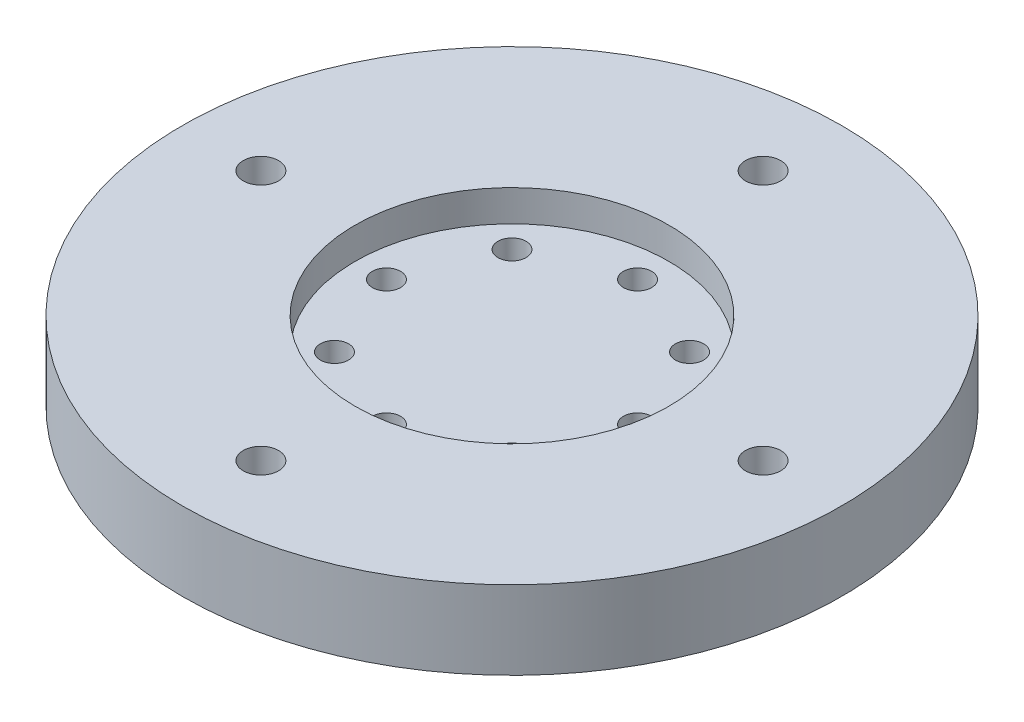
ISO-10303-21;
HEADER;
FILE_DESCRIPTION(('STEP AP214'),'2;1');
FILE_NAME('part.step','',(''),(''),'','','');
FILE_SCHEMA(('AUTOMOTIVE_DESIGN { 1 0 10303 214 1 1 1 1 }'));
ENDSEC;
DATA;
#1=APPLICATION_CONTEXT('core data for automotive mechanical design processes');
#2=APPLICATION_PROTOCOL_DEFINITION('international standard','automotive_design',2000,#1);
#3=PRODUCT_CONTEXT('',#1,'mechanical');
#4=PRODUCT('Part','Part','',(#3));
#5=PRODUCT_RELATED_PRODUCT_CATEGORY('part','',(#4));
#6=PRODUCT_DEFINITION_FORMATION('','',#4);
#7=PRODUCT_DEFINITION_CONTEXT('part definition',#1,'design');
#8=PRODUCT_DEFINITION('design','',#6,#7);
#9=PRODUCT_DEFINITION_SHAPE('','',#8);
#10=(LENGTH_UNIT() NAMED_UNIT(*) SI_UNIT(.MILLI.,.METRE.));
#11=(NAMED_UNIT(*) PLANE_ANGLE_UNIT() SI_UNIT($,.RADIAN.));
#12=(NAMED_UNIT(*) SI_UNIT($,.STERADIAN.) SOLID_ANGLE_UNIT());
#13=UNCERTAINTY_MEASURE_WITH_UNIT(LENGTH_MEASURE(1.E-05),#10,'distance_accuracy_value','');
#14=(GEOMETRIC_REPRESENTATION_CONTEXT(3) GLOBAL_UNCERTAINTY_ASSIGNED_CONTEXT((#13)) GLOBAL_UNIT_ASSIGNED_CONTEXT((#10,
#11,#12)) REPRESENTATION_CONTEXT('',''));
#15=CARTESIAN_POINT('',(0.,0.,0.));
#16=DIRECTION('',(0.,0.,1.));
#17=DIRECTION('',(1.,0.,0.));
#18=AXIS2_PLACEMENT_3D('',#15,#16,#17);
#19=CARTESIAN_POINT('',(0.,5.,0.));
#20=DIRECTION('',(0.,-1.,0.));
#21=DIRECTION('',(0.,0.,-1.));
#22=AXIS2_PLACEMENT_3D('',#19,#20,#21);
#23=CYLINDRICAL_SURFACE('',#22,21.);
#24=CARTESIAN_POINT('',(0.,5.,0.));
#25=DIRECTION('',(0.,1.,0.));
#26=DIRECTION('',(0.,0.,1.));
#27=AXIS2_PLACEMENT_3D('',#24,#25,#26);
#28=CIRCLE('',#27,21.);
#29=CARTESIAN_POINT('',(0.,5.,21.));
#30=VERTEX_POINT('',#29);
#31=EDGE_CURVE('E10',#30,#30,#28,.T.);
#32=ORIENTED_EDGE('',*,*,#31,.F.);
#33=EDGE_LOOP('',(#32));
#34=FACE_BOUND('',#33,.T.);
#35=CARTESIAN_POINT('',(0.,0.,0.));
#36=DIRECTION('',(0.,1.,0.));
#37=DIRECTION('',(0.,0.,1.));
#38=AXIS2_PLACEMENT_3D('',#35,#36,#37);
#39=CIRCLE('',#38,21.);
#40=CARTESIAN_POINT('',(0.,0.,21.));
#41=VERTEX_POINT('',#40);
#42=EDGE_CURVE('E34',#41,#41,#39,.T.);
#43=ORIENTED_EDGE('',*,*,#42,.T.);
#44=EDGE_LOOP('',(#43));
#45=FACE_BOUND('',#44,.T.);
#46=ADVANCED_FACE('F31',(#34,#45),#23,.T.);
#47=CARTESIAN_POINT('',(0.,5.,0.));
#48=DIRECTION('',(0.,1.,0.));
#49=DIRECTION('',(0.,0.,1.));
#50=AXIS2_PLACEMENT_3D('',#47,#48,#49);
#51=PLANE('',#50);
#52=CARTESIAN_POINT('',(-16.,5.,0.));
#53=DIRECTION('',(0.,1.,0.));
#54=DIRECTION('',(0.,0.,1.));
#55=AXIS2_PLACEMENT_3D('',#52,#53,#54);
#56=CIRCLE('',#55,1.125);
#57=CARTESIAN_POINT('',(-16.,5.,1.125));
#58=VERTEX_POINT('',#57);
#59=EDGE_CURVE('E102',#58,#58,#56,.F.);
#60=ORIENTED_EDGE('',*,*,#59,.T.);
#61=EDGE_LOOP('',(#60));
#62=FACE_BOUND('',#61,.T.);
#63=CARTESIAN_POINT('',(0.,5.,16.));
#64=DIRECTION('',(0.,1.,0.));
#65=DIRECTION('',(0.,0.,1.));
#66=AXIS2_PLACEMENT_3D('',#63,#64,#65);
#67=CIRCLE('',#66,1.125);
#68=CARTESIAN_POINT('',(0.,5.,17.125));
#69=VERTEX_POINT('',#68);
#70=EDGE_CURVE('E110',#69,#69,#67,.F.);
#71=ORIENTED_EDGE('',*,*,#70,.T.);
#72=EDGE_LOOP('',(#71));
#73=FACE_BOUND('',#72,.T.);
#74=CARTESIAN_POINT('',(16.,5.,0.));
#75=DIRECTION('',(0.,1.,0.));
#76=DIRECTION('',(0.,0.,1.));
#77=AXIS2_PLACEMENT_3D('',#74,#75,#76);
#78=CIRCLE('',#77,1.125);
#79=CARTESIAN_POINT('',(16.,5.,1.125));
#80=VERTEX_POINT('',#79);
#81=EDGE_CURVE('E103',#80,#80,#78,.F.);
#82=ORIENTED_EDGE('',*,*,#81,.T.);
#83=EDGE_LOOP('',(#82));
#84=FACE_BOUND('',#83,.T.);
#85=CARTESIAN_POINT('',(0.,5.,-16.));
#86=DIRECTION('',(0.,1.,0.));
#87=DIRECTION('',(0.,0.,1.));
#88=AXIS2_PLACEMENT_3D('',#85,#86,#87);
#89=CIRCLE('',#88,1.125);
#90=CARTESIAN_POINT('',(0.,5.,-14.875));
#91=VERTEX_POINT('',#90);
#92=EDGE_CURVE('E80',#91,#91,#89,.F.);
#93=ORIENTED_EDGE('',*,*,#92,.T.);
#94=EDGE_LOOP('',(#93));
#95=FACE_BOUND('',#94,.T.);
#96=CARTESIAN_POINT('',(0.,5.,0.));
#97=DIRECTION('',(0.,1.,0.));
#98=DIRECTION('',(0.,0.,1.));
#99=AXIS2_PLACEMENT_3D('',#96,#97,#98);
#100=CIRCLE('',#99,10.);
#101=CARTESIAN_POINT('',(0.,5.,10.));
#102=VERTEX_POINT('',#101);
#103=EDGE_CURVE('E43',#102,#102,#100,.T.);
#104=ORIENTED_EDGE('',*,*,#103,.F.);
#105=EDGE_LOOP('',(#104));
#106=FACE_BOUND('',#105,.T.);
#107=ORIENTED_EDGE('',*,*,#31,.T.);
#108=EDGE_LOOP('',(#107));
#109=FACE_BOUND('',#108,.T.);
#110=ADVANCED_FACE('F128',(#62,#73,#84,#95,#106,#109),#51,.T.);
#111=CARTESIAN_POINT('',(0.,0.,0.));
#112=DIRECTION('',(0.,1.,0.));
#113=DIRECTION('',(0.,0.,1.));
#114=AXIS2_PLACEMENT_3D('',#111,#112,#113);
#115=PLANE('',#114);
#116=CARTESIAN_POINT('',(-16.,0.,0.));
#117=DIRECTION('',(0.,-1.,0.));
#118=DIRECTION('',(0.,0.,-1.));
#119=AXIS2_PLACEMENT_3D('',#116,#117,#118);
#120=CIRCLE('',#119,1.125);
#121=CARTESIAN_POINT('',(-16.,0.,-1.125));
#122=VERTEX_POINT('',#121);
#123=EDGE_CURVE('E113',#122,#122,#120,.T.);
#124=ORIENTED_EDGE('',*,*,#123,.F.);
#125=EDGE_LOOP('',(#124));
#126=FACE_BOUND('',#125,.T.);
#127=CARTESIAN_POINT('',(0.,0.,16.));
#128=DIRECTION('',(0.,-1.,0.));
#129=DIRECTION('',(0.,0.,-1.));
#130=AXIS2_PLACEMENT_3D('',#127,#128,#129);
#131=CIRCLE('',#130,1.125);
#132=CARTESIAN_POINT('',(0.,0.,14.875));
#133=VERTEX_POINT('',#132);
#134=EDGE_CURVE('E106',#133,#133,#131,.T.);
#135=ORIENTED_EDGE('',*,*,#134,.F.);
#136=EDGE_LOOP('',(#135));
#137=FACE_BOUND('',#136,.T.);
#138=CARTESIAN_POINT('',(16.,0.,0.));
#139=DIRECTION('',(0.,-1.,0.));
#140=DIRECTION('',(0.,0.,-1.));
#141=AXIS2_PLACEMENT_3D('',#138,#139,#140);
#142=CIRCLE('',#141,1.125);
#143=CARTESIAN_POINT('',(16.,0.,-1.125));
#144=VERTEX_POINT('',#143);
#145=EDGE_CURVE('E107',#144,#144,#142,.T.);
#146=ORIENTED_EDGE('',*,*,#145,.F.);
#147=EDGE_LOOP('',(#146));
#148=FACE_BOUND('',#147,.T.);
#149=CARTESIAN_POINT('',(0.,0.,-16.));
#150=DIRECTION('',(0.,-1.,0.));
#151=DIRECTION('',(0.,0.,-1.));
#152=AXIS2_PLACEMENT_3D('',#149,#150,#151);
#153=CIRCLE('',#152,1.125);
#154=CARTESIAN_POINT('',(0.,0.,-17.125));
#155=VERTEX_POINT('',#154);
#156=EDGE_CURVE('E99',#155,#155,#153,.T.);
#157=ORIENTED_EDGE('',*,*,#156,.F.);
#158=EDGE_LOOP('',(#157));
#159=FACE_BOUND('',#158,.T.);
#160=CARTESIAN_POINT('',(-5.65685424949238,0.,-5.65685424949238));
#161=DIRECTION('',(0.,1.,0.));
#162=DIRECTION('',(0.,0.,1.));
#163=AXIS2_PLACEMENT_3D('',#160,#161,#162);
#164=CIRCLE('',#163,0.9);
#165=CARTESIAN_POINT('',(-5.65685424949238,0.,-4.75685424949238));
#166=VERTEX_POINT('',#165);
#167=EDGE_CURVE('E73',#166,#166,#164,.F.);
#168=ORIENTED_EDGE('',*,*,#167,.F.);
#169=EDGE_LOOP('',(#168));
#170=FACE_BOUND('',#169,.T.);
#171=CARTESIAN_POINT('',(-8.,0.,0.));
#172=DIRECTION('',(0.,1.,0.));
#173=DIRECTION('',(0.,0.,1.));
#174=AXIS2_PLACEMENT_3D('',#171,#172,#173);
#175=CIRCLE('',#174,0.9);
#176=CARTESIAN_POINT('',(-8.,0.,0.9));
#177=VERTEX_POINT('',#176);
#178=EDGE_CURVE('E81',#177,#177,#175,.F.);
#179=ORIENTED_EDGE('',*,*,#178,.F.);
#180=EDGE_LOOP('',(#179));
#181=FACE_BOUND('',#180,.T.);
#182=CARTESIAN_POINT('',(-5.65685424949238,0.,5.65685424949238));
#183=DIRECTION('',(0.,1.,0.));
#184=DIRECTION('',(0.,0.,1.));
#185=AXIS2_PLACEMENT_3D('',#182,#183,#184);
#186=CIRCLE('',#185,0.9);
#187=CARTESIAN_POINT('',(-5.65685424949238,0.,6.55685424949238));
#188=VERTEX_POINT('',#187);
#189=EDGE_CURVE('E87',#188,#188,#186,.F.);
#190=ORIENTED_EDGE('',*,*,#189,.F.);
#191=EDGE_LOOP('',(#190));
#192=FACE_BOUND('',#191,.T.);
#193=CARTESIAN_POINT('',(0.,0.,8.));
#194=DIRECTION('',(0.,1.,0.));
#195=DIRECTION('',(0.,0.,1.));
#196=AXIS2_PLACEMENT_3D('',#193,#194,#195);
#197=CIRCLE('',#196,0.9);
#198=CARTESIAN_POINT('',(0.,0.,8.9));
#199=VERTEX_POINT('',#198);
#200=EDGE_CURVE('E62',#199,#199,#197,.F.);
#201=ORIENTED_EDGE('',*,*,#200,.F.);
#202=EDGE_LOOP('',(#201));
#203=FACE_BOUND('',#202,.T.);
#204=CARTESIAN_POINT('',(5.65685424949238,0.,5.65685424949238));
#205=DIRECTION('',(0.,1.,0.));
#206=DIRECTION('',(0.,0.,1.));
#207=AXIS2_PLACEMENT_3D('',#204,#205,#206);
#208=CIRCLE('',#207,0.9);
#209=CARTESIAN_POINT('',(5.65685424949238,0.,6.55685424949238));
#210=VERTEX_POINT('',#209);
#211=EDGE_CURVE('E55',#210,#210,#208,.F.);
#212=ORIENTED_EDGE('',*,*,#211,.F.);
#213=EDGE_LOOP('',(#212));
#214=FACE_BOUND('',#213,.T.);
#215=CARTESIAN_POINT('',(0.,0.,-8.));
#216=DIRECTION('',(0.,1.,0.));
#217=DIRECTION('',(0.,0.,1.));
#218=AXIS2_PLACEMENT_3D('',#215,#216,#217);
#219=CIRCLE('',#218,0.9);
#220=CARTESIAN_POINT('',(0.,0.,-7.1));
#221=VERTEX_POINT('',#220);
#222=EDGE_CURVE('E63',#221,#221,#219,.F.);
#223=ORIENTED_EDGE('',*,*,#222,.F.);
#224=EDGE_LOOP('',(#223));
#225=FACE_BOUND('',#224,.T.);
#226=CARTESIAN_POINT('',(8.,0.,0.));
#227=DIRECTION('',(0.,1.,0.));
#228=DIRECTION('',(0.,0.,1.));
#229=AXIS2_PLACEMENT_3D('',#226,#227,#228);
#230=CIRCLE('',#229,0.9);
#231=CARTESIAN_POINT('',(8.,0.,0.9));
#232=VERTEX_POINT('',#231);
#233=EDGE_CURVE('E54',#232,#232,#230,.F.);
#234=ORIENTED_EDGE('',*,*,#233,.F.);
#235=EDGE_LOOP('',(#234));
#236=FACE_BOUND('',#235,.T.);
#237=CARTESIAN_POINT('',(5.65685424949238,0.,-5.65685424949238));
#238=DIRECTION('',(0.,1.,0.));
#239=DIRECTION('',(0.,0.,1.));
#240=AXIS2_PLACEMENT_3D('',#237,#238,#239);
#241=CIRCLE('',#240,0.899999999999999);
#242=CARTESIAN_POINT('',(5.65685424949238,0.,-4.75685424949238));
#243=VERTEX_POINT('',#242);
#244=EDGE_CURVE('E46',#243,#243,#241,.F.);
#245=ORIENTED_EDGE('',*,*,#244,.F.);
#246=EDGE_LOOP('',(#245));
#247=FACE_BOUND('',#246,.T.);
#248=ORIENTED_EDGE('',*,*,#42,.F.);
#249=EDGE_LOOP('',(#248));
#250=FACE_BOUND('',#249,.T.);
#251=ADVANCED_FACE('F124',(#126,#137,#148,#159,#170,#181,#192,#203,#214,#225,#236,#247,#250),
#115,.F.);
#252=CARTESIAN_POINT('',(0.,3.,0.));
#253=DIRECTION('',(0.,1.,0.));
#254=DIRECTION('',(0.,0.,1.));
#255=AXIS2_PLACEMENT_3D('',#252,#253,#254);
#256=CYLINDRICAL_SURFACE('',#255,10.);
#257=CARTESIAN_POINT('',(0.,3.,0.));
#258=DIRECTION('',(0.,1.,0.));
#259=DIRECTION('',(0.,0.,1.));
#260=AXIS2_PLACEMENT_3D('',#257,#258,#259);
#261=CIRCLE('',#260,10.);
#262=CARTESIAN_POINT('',(0.,3.,10.));
#263=VERTEX_POINT('',#262);
#264=EDGE_CURVE('E41',#263,#263,#261,.T.);
#265=ORIENTED_EDGE('',*,*,#264,.F.);
#266=EDGE_LOOP('',(#265));
#267=FACE_BOUND('',#266,.T.);
#268=ORIENTED_EDGE('',*,*,#103,.T.);
#269=EDGE_LOOP('',(#268));
#270=FACE_BOUND('',#269,.T.);
#271=ADVANCED_FACE('F127',(#267,#270),#256,.F.);
#272=CARTESIAN_POINT('',(0.,3.,0.));
#273=DIRECTION('',(0.,1.,0.));
#274=DIRECTION('',(0.,0.,1.));
#275=AXIS2_PLACEMENT_3D('',#272,#273,#274);
#276=PLANE('',#275);
#277=CARTESIAN_POINT('',(-5.65685424949238,3.,-5.65685424949238));
#278=DIRECTION('',(0.,1.,0.));
#279=DIRECTION('',(0.,0.,-1.));
#280=AXIS2_PLACEMENT_3D('',#277,#278,#279);
#281=CIRCLE('',#280,0.9);
#282=CARTESIAN_POINT('',(-5.65685424949238,3.,-6.55685424949238));
#283=VERTEX_POINT('',#282);
#284=EDGE_CURVE('E77',#283,#283,#281,.T.);
#285=ORIENTED_EDGE('',*,*,#284,.F.);
#286=EDGE_LOOP('',(#285));
#287=FACE_BOUND('',#286,.T.);
#288=CARTESIAN_POINT('',(-8.,3.,0.));
#289=DIRECTION('',(0.,1.,0.));
#290=DIRECTION('',(0.,0.,-1.));
#291=AXIS2_PLACEMENT_3D('',#288,#289,#290);
#292=CIRCLE('',#291,0.9);
#293=CARTESIAN_POINT('',(-8.,3.,-0.9));
#294=VERTEX_POINT('',#293);
#295=EDGE_CURVE('E76',#294,#294,#292,.T.);
#296=ORIENTED_EDGE('',*,*,#295,.F.);
#297=EDGE_LOOP('',(#296));
#298=FACE_BOUND('',#297,.T.);
#299=CARTESIAN_POINT('',(-5.65685424949238,3.,5.65685424949238));
#300=DIRECTION('',(0.,1.,0.));
#301=DIRECTION('',(0.,0.,1.));
#302=AXIS2_PLACEMENT_3D('',#299,#300,#301);
#303=CIRCLE('',#302,0.9);
#304=CARTESIAN_POINT('',(-5.65685424949238,3.,6.55685424949238));
#305=VERTEX_POINT('',#304);
#306=EDGE_CURVE('E84',#305,#305,#303,.T.);
#307=ORIENTED_EDGE('',*,*,#306,.F.);
#308=EDGE_LOOP('',(#307));
#309=FACE_BOUND('',#308,.T.);
#310=CARTESIAN_POINT('',(0.,3.,8.));
#311=DIRECTION('',(0.,1.,0.));
#312=DIRECTION('',(0.,0.,-1.));
#313=AXIS2_PLACEMENT_3D('',#310,#311,#312);
#314=CIRCLE('',#313,0.9);
#315=CARTESIAN_POINT('',(0.,3.,7.1));
#316=VERTEX_POINT('',#315);
#317=EDGE_CURVE('E90',#316,#316,#314,.T.);
#318=ORIENTED_EDGE('',*,*,#317,.F.);
#319=EDGE_LOOP('',(#318));
#320=FACE_BOUND('',#319,.T.);
#321=CARTESIAN_POINT('',(5.65685424949238,3.,5.65685424949238));
#322=DIRECTION('',(0.,1.,0.));
#323=DIRECTION('',(0.,0.,-1.));
#324=AXIS2_PLACEMENT_3D('',#321,#322,#323);
#325=CIRCLE('',#324,0.9);
#326=CARTESIAN_POINT('',(5.65685424949238,3.,4.75685424949238));
#327=VERTEX_POINT('',#326);
#328=EDGE_CURVE('E59',#327,#327,#325,.T.);
#329=ORIENTED_EDGE('',*,*,#328,.F.);
#330=EDGE_LOOP('',(#329));
#331=FACE_BOUND('',#330,.T.);
#332=CARTESIAN_POINT('',(0.,3.,-8.));
#333=DIRECTION('',(0.,1.,0.));
#334=DIRECTION('',(0.,0.,1.));
#335=AXIS2_PLACEMENT_3D('',#332,#333,#334);
#336=CIRCLE('',#335,0.9);
#337=CARTESIAN_POINT('',(0.,3.,-7.1));
#338=VERTEX_POINT('',#337);
#339=EDGE_CURVE('E58',#338,#338,#336,.T.);
#340=ORIENTED_EDGE('',*,*,#339,.F.);
#341=EDGE_LOOP('',(#340));
#342=FACE_BOUND('',#341,.T.);
#343=CARTESIAN_POINT('',(8.,3.,0.));
#344=DIRECTION('',(0.,1.,0.));
#345=DIRECTION('',(0.,0.,1.));
#346=AXIS2_PLACEMENT_3D('',#343,#344,#345);
#347=CIRCLE('',#346,0.9);
#348=CARTESIAN_POINT('',(8.,3.,0.9));
#349=VERTEX_POINT('',#348);
#350=EDGE_CURVE('E66',#349,#349,#347,.T.);
#351=ORIENTED_EDGE('',*,*,#350,.F.);
#352=EDGE_LOOP('',(#351));
#353=FACE_BOUND('',#352,.T.);
#354=CARTESIAN_POINT('',(5.65685424949238,3.,-5.65685424949238));
#355=DIRECTION('',(0.,1.,0.));
#356=DIRECTION('',(0.,0.,1.));
#357=AXIS2_PLACEMENT_3D('',#354,#355,#356);
#358=CIRCLE('',#357,0.899999999999999);
#359=CARTESIAN_POINT('',(5.65685424949238,3.,-4.75685424949238));
#360=VERTEX_POINT('',#359);
#361=EDGE_CURVE('E51',#360,#360,#358,.T.);
#362=ORIENTED_EDGE('',*,*,#361,.F.);
#363=EDGE_LOOP('',(#362));
#364=FACE_BOUND('',#363,.T.);
#365=ORIENTED_EDGE('',*,*,#264,.T.);
#366=EDGE_LOOP('',(#365));
#367=FACE_BOUND('',#366,.T.);
#368=ADVANCED_FACE('F166',(#287,#298,#309,#320,#331,#342,#353,#364,#367),#276,.T.);
#369=CARTESIAN_POINT('',(5.65685424949238,-2.54558441227157,-5.65685424949238));
#370=DIRECTION('',(0.,1.,0.));
#371=DIRECTION('',(0.,0.,1.));
#372=AXIS2_PLACEMENT_3D('',#369,#370,#371);
#373=CYLINDRICAL_SURFACE('',#372,0.899999999999999);
#374=ORIENTED_EDGE('',*,*,#244,.T.);
#375=EDGE_LOOP('',(#374));
#376=FACE_BOUND('',#375,.T.);
#377=ORIENTED_EDGE('',*,*,#361,.T.);
#378=EDGE_LOOP('',(#377));
#379=FACE_BOUND('',#378,.T.);
#380=ADVANCED_FACE('F170',(#376,#379),#373,.F.);
#381=CARTESIAN_POINT('',(8.,-2.54558441227157,0.));
#382=DIRECTION('',(0.,1.,0.));
#383=DIRECTION('',(0.,0.,1.));
#384=AXIS2_PLACEMENT_3D('',#381,#382,#383);
#385=CYLINDRICAL_SURFACE('',#384,0.9);
#386=ORIENTED_EDGE('',*,*,#233,.T.);
#387=EDGE_LOOP('',(#386));
#388=FACE_BOUND('',#387,.T.);
#389=ORIENTED_EDGE('',*,*,#350,.T.);
#390=EDGE_LOOP('',(#389));
#391=FACE_BOUND('',#390,.T.);
#392=ADVANCED_FACE('F174',(#388,#391),#385,.F.);
#393=CARTESIAN_POINT('',(0.,-2.54558441227157,-8.));
#394=DIRECTION('',(0.,1.,0.));
#395=DIRECTION('',(0.,0.,1.));
#396=AXIS2_PLACEMENT_3D('',#393,#394,#395);
#397=CYLINDRICAL_SURFACE('',#396,0.9);
#398=ORIENTED_EDGE('',*,*,#222,.T.);
#399=EDGE_LOOP('',(#398));
#400=FACE_BOUND('',#399,.T.);
#401=ORIENTED_EDGE('',*,*,#339,.T.);
#402=EDGE_LOOP('',(#401));
#403=FACE_BOUND('',#402,.T.);
#404=ADVANCED_FACE('F180',(#400,#403),#397,.F.);
#405=CARTESIAN_POINT('',(5.65685424949238,-2.54558441227157,5.65685424949238));
#406=DIRECTION('',(0.,1.,0.));
#407=DIRECTION('',(0.,0.,1.));
#408=AXIS2_PLACEMENT_3D('',#405,#406,#407);
#409=CYLINDRICAL_SURFACE('',#408,0.9);
#410=ORIENTED_EDGE('',*,*,#211,.T.);
#411=EDGE_LOOP('',(#410));
#412=FACE_BOUND('',#411,.T.);
#413=ORIENTED_EDGE('',*,*,#328,.T.);
#414=EDGE_LOOP('',(#413));
#415=FACE_BOUND('',#414,.T.);
#416=ADVANCED_FACE('F176',(#412,#415),#409,.F.);
#417=CARTESIAN_POINT('',(0.,-2.54558441227157,8.));
#418=DIRECTION('',(0.,1.,0.));
#419=DIRECTION('',(0.,0.,1.));
#420=AXIS2_PLACEMENT_3D('',#417,#418,#419);
#421=CYLINDRICAL_SURFACE('',#420,0.9);
#422=ORIENTED_EDGE('',*,*,#200,.T.);
#423=EDGE_LOOP('',(#422));
#424=FACE_BOUND('',#423,.T.);
#425=ORIENTED_EDGE('',*,*,#317,.T.);
#426=EDGE_LOOP('',(#425));
#427=FACE_BOUND('',#426,.T.);
#428=ADVANCED_FACE('F179',(#424,#427),#421,.F.);
#429=CARTESIAN_POINT('',(-5.65685424949238,-2.54558441227157,5.65685424949238));
#430=DIRECTION('',(0.,1.,0.));
#431=DIRECTION('',(0.,0.,1.));
#432=AXIS2_PLACEMENT_3D('',#429,#430,#431);
#433=CYLINDRICAL_SURFACE('',#432,0.9);
#434=ORIENTED_EDGE('',*,*,#189,.T.);
#435=EDGE_LOOP('',(#434));
#436=FACE_BOUND('',#435,.T.);
#437=ORIENTED_EDGE('',*,*,#306,.T.);
#438=EDGE_LOOP('',(#437));
#439=FACE_BOUND('',#438,.T.);
#440=ADVANCED_FACE('F196',(#436,#439),#433,.F.);
#441=CARTESIAN_POINT('',(-8.,-2.54558441227157,0.));
#442=DIRECTION('',(0.,1.,0.));
#443=DIRECTION('',(0.,0.,1.));
#444=AXIS2_PLACEMENT_3D('',#441,#442,#443);
#445=CYLINDRICAL_SURFACE('',#444,0.9);
#446=ORIENTED_EDGE('',*,*,#178,.T.);
#447=EDGE_LOOP('',(#446));
#448=FACE_BOUND('',#447,.T.);
#449=ORIENTED_EDGE('',*,*,#295,.T.);
#450=EDGE_LOOP('',(#449));
#451=FACE_BOUND('',#450,.T.);
#452=ADVANCED_FACE('F192',(#448,#451),#445,.F.);
#453=CARTESIAN_POINT('',(-5.65685424949238,-2.54558441227157,-5.65685424949238));
#454=DIRECTION('',(0.,1.,0.));
#455=DIRECTION('',(0.,0.,1.));
#456=AXIS2_PLACEMENT_3D('',#453,#454,#455);
#457=CYLINDRICAL_SURFACE('',#456,0.9);
#458=ORIENTED_EDGE('',*,*,#167,.T.);
#459=EDGE_LOOP('',(#458));
#460=FACE_BOUND('',#459,.T.);
#461=ORIENTED_EDGE('',*,*,#284,.T.);
#462=EDGE_LOOP('',(#461));
#463=FACE_BOUND('',#462,.T.);
#464=ADVANCED_FACE('F188',(#460,#463),#457,.F.);
#465=CARTESIAN_POINT('',(0.,8.18198051533947,-16.));
#466=DIRECTION('',(0.,-1.,0.));
#467=DIRECTION('',(0.,0.,-1.));
#468=AXIS2_PLACEMENT_3D('',#465,#466,#467);
#469=CYLINDRICAL_SURFACE('',#468,1.125);
#470=ORIENTED_EDGE('',*,*,#156,.T.);
#471=EDGE_LOOP('',(#470));
#472=FACE_BOUND('',#471,.T.);
#473=ORIENTED_EDGE('',*,*,#92,.F.);
#474=EDGE_LOOP('',(#473));
#475=FACE_BOUND('',#474,.T.);
#476=ADVANCED_FACE('F191',(#472,#475),#469,.F.);
#477=CARTESIAN_POINT('',(16.,8.18198051533947,0.));
#478=DIRECTION('',(0.,-1.,0.));
#479=DIRECTION('',(0.,0.,-1.));
#480=AXIS2_PLACEMENT_3D('',#477,#478,#479);
#481=CYLINDRICAL_SURFACE('',#480,1.125);
#482=ORIENTED_EDGE('',*,*,#145,.T.);
#483=EDGE_LOOP('',(#482));
#484=FACE_BOUND('',#483,.T.);
#485=ORIENTED_EDGE('',*,*,#81,.F.);
#486=EDGE_LOOP('',(#485));
#487=FACE_BOUND('',#486,.T.);
#488=ADVANCED_FACE('F206',(#484,#487),#481,.F.);
#489=CARTESIAN_POINT('',(0.,8.18198051533947,16.));
#490=DIRECTION('',(0.,-1.,0.));
#491=DIRECTION('',(0.,0.,-1.));
#492=AXIS2_PLACEMENT_3D('',#489,#490,#491);
#493=CYLINDRICAL_SURFACE('',#492,1.125);
#494=ORIENTED_EDGE('',*,*,#134,.T.);
#495=EDGE_LOOP('',(#494));
#496=FACE_BOUND('',#495,.T.);
#497=ORIENTED_EDGE('',*,*,#70,.F.);
#498=EDGE_LOOP('',(#497));
#499=FACE_BOUND('',#498,.T.);
#500=ADVANCED_FACE('F210',(#496,#499),#493,.F.);
#501=CARTESIAN_POINT('',(-16.,8.18198051533947,0.));
#502=DIRECTION('',(0.,-1.,0.));
#503=DIRECTION('',(0.,0.,-1.));
#504=AXIS2_PLACEMENT_3D('',#501,#502,#503);
#505=CYLINDRICAL_SURFACE('',#504,1.125);
#506=ORIENTED_EDGE('',*,*,#123,.T.);
#507=EDGE_LOOP('',(#506));
#508=FACE_BOUND('',#507,.T.);
#509=ORIENTED_EDGE('',*,*,#59,.F.);
#510=EDGE_LOOP('',(#509));
#511=FACE_BOUND('',#510,.T.);
#512=ADVANCED_FACE('F121',(#508,#511),#505,.F.);
#513=CLOSED_SHELL('',(#46,#110,#251,#271,#368,#380,#392,#404,#416,#428,#440,#452,#464,#476,#488,
#500,#512));
#514=MANIFOLD_SOLID_BREP('B2',#513);
#515=ADVANCED_BREP_SHAPE_REPRESENTATION('',(#18,#514),#14);
#516=SHAPE_DEFINITION_REPRESENTATION(#9,#515);
ENDSEC;
END-ISO-10303-21;
